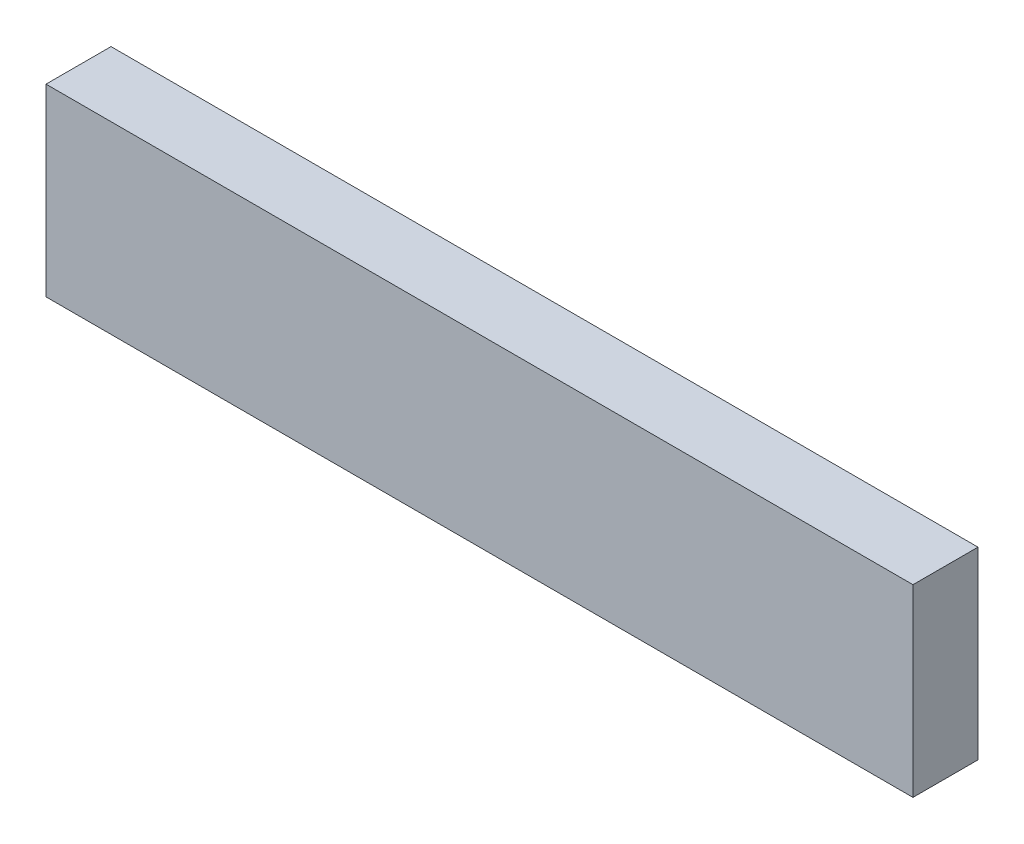
ISO-10303-21;
HEADER;
FILE_DESCRIPTION(('STEP AP214'),'2;1');
FILE_NAME('part.step','',(''),(''),'','','');
FILE_SCHEMA(('AUTOMOTIVE_DESIGN { 1 0 10303 214 1 1 1 1 }'));
ENDSEC;
DATA;
#1=APPLICATION_CONTEXT('core data for automotive mechanical design processes');
#2=APPLICATION_PROTOCOL_DEFINITION('international standard','automotive_design',2000,#1);
#3=PRODUCT_CONTEXT('',#1,'mechanical');
#4=PRODUCT('Part','Part','',(#3));
#5=PRODUCT_RELATED_PRODUCT_CATEGORY('part','',(#4));
#6=PRODUCT_DEFINITION_FORMATION('','',#4);
#7=PRODUCT_DEFINITION_CONTEXT('part definition',#1,'design');
#8=PRODUCT_DEFINITION('design','',#6,#7);
#9=PRODUCT_DEFINITION_SHAPE('','',#8);
#10=(LENGTH_UNIT() NAMED_UNIT(*) SI_UNIT(.MILLI.,.METRE.));
#11=(NAMED_UNIT(*) PLANE_ANGLE_UNIT() SI_UNIT($,.RADIAN.));
#12=(NAMED_UNIT(*) SI_UNIT($,.STERADIAN.) SOLID_ANGLE_UNIT());
#13=UNCERTAINTY_MEASURE_WITH_UNIT(LENGTH_MEASURE(1.E-05),#10,'distance_accuracy_value','');
#14=(GEOMETRIC_REPRESENTATION_CONTEXT(3) GLOBAL_UNCERTAINTY_ASSIGNED_CONTEXT((#13)) GLOBAL_UNIT_ASSIGNED_CONTEXT((#10,
#11,#12)) REPRESENTATION_CONTEXT('',''));
#15=CARTESIAN_POINT('',(0.,0.,0.));
#16=DIRECTION('',(0.,0.,1.));
#17=DIRECTION('',(1.,0.,0.));
#18=AXIS2_PLACEMENT_3D('',#15,#16,#17);
#19=CARTESIAN_POINT('',(0.,0.,-30.));
#20=DIRECTION('',(-1.,0.,0.));
#21=DIRECTION('',(0.,-1.,0.));
#22=AXIS2_PLACEMENT_3D('',#19,#20,#21);
#23=PLANE('',#22);
#24=DIRECTION('',(0.,-1.,0.));
#25=VECTOR('',#24,1.);
#26=CARTESIAN_POINT('',(0.,0.,0.));
#27=LINE('',#26,#25);
#28=CARTESIAN_POINT('',(0.,0.,0.));
#29=VERTEX_POINT('',#28);
#30=CARTESIAN_POINT('',(0.,-85.,0.));
#31=VERTEX_POINT('',#30);
#32=EDGE_CURVE('E102',#29,#31,#27,.T.);
#33=ORIENTED_EDGE('',*,*,#32,.F.);
#34=DIRECTION('',(0.,0.,1.));
#35=VECTOR('',#34,1.);
#36=CARTESIAN_POINT('',(0.,0.,-30.));
#37=LINE('',#36,#35);
#38=CARTESIAN_POINT('',(0.,0.,-30.));
#39=VERTEX_POINT('',#38);
#40=EDGE_CURVE('E11',#39,#29,#37,.T.);
#41=ORIENTED_EDGE('',*,*,#40,.F.);
#42=DIRECTION('',(0.,-1.,0.));
#43=VECTOR('',#42,1.);
#44=CARTESIAN_POINT('',(0.,0.,-30.));
#45=LINE('',#44,#43);
#46=CARTESIAN_POINT('',(0.,-85.,-30.));
#47=VERTEX_POINT('',#46);
#48=EDGE_CURVE('E96',#39,#47,#45,.T.);
#49=ORIENTED_EDGE('',*,*,#48,.T.);
#50=DIRECTION('',(0.,0.,1.));
#51=VECTOR('',#50,1.);
#52=CARTESIAN_POINT('',(0.,-85.,-30.));
#53=LINE('',#52,#51);
#54=EDGE_CURVE('E41',#47,#31,#53,.T.);
#55=ORIENTED_EDGE('',*,*,#54,.T.);
#56=EDGE_LOOP('',(#33,#41,#49,#55));
#57=FACE_BOUND('',#56,.T.);
#58=ADVANCED_FACE('F38',(#57),#23,.T.);
#59=CARTESIAN_POINT('',(0.,0.,-30.));
#60=DIRECTION('',(0.,1.,0.));
#61=DIRECTION('',(0.,0.,1.));
#62=AXIS2_PLACEMENT_3D('',#59,#60,#61);
#63=PLANE('',#62);
#64=DIRECTION('',(-1.,0.,0.));
#65=VECTOR('',#64,1.);
#66=CARTESIAN_POINT('',(0.,0.,0.));
#67=LINE('',#66,#65);
#68=CARTESIAN_POINT('',(400.,0.,0.));
#69=VERTEX_POINT('',#68);
#70=EDGE_CURVE('E98',#69,#29,#67,.T.);
#71=ORIENTED_EDGE('',*,*,#70,.F.);
#72=DIRECTION('',(0.,0.,1.));
#73=VECTOR('',#72,1.);
#74=CARTESIAN_POINT('',(400.,0.,-30.));
#75=LINE('',#74,#73);
#76=CARTESIAN_POINT('',(400.,0.,-30.));
#77=VERTEX_POINT('',#76);
#78=EDGE_CURVE('E47',#77,#69,#75,.T.);
#79=ORIENTED_EDGE('',*,*,#78,.F.);
#80=DIRECTION('',(-1.,0.,0.));
#81=VECTOR('',#80,1.);
#82=CARTESIAN_POINT('',(0.,0.,-30.));
#83=LINE('',#82,#81);
#84=EDGE_CURVE('E93',#77,#39,#83,.T.);
#85=ORIENTED_EDGE('',*,*,#84,.T.);
#86=ORIENTED_EDGE('',*,*,#40,.T.);
#87=EDGE_LOOP('',(#71,#79,#85,#86));
#88=FACE_BOUND('',#87,.T.);
#89=ADVANCED_FACE('F112',(#88),#63,.T.);
#90=CARTESIAN_POINT('',(400.,0.,-30.));
#91=DIRECTION('',(1.,0.,0.));
#92=DIRECTION('',(0.,0.,-1.));
#93=AXIS2_PLACEMENT_3D('',#90,#91,#92);
#94=PLANE('',#93);
#95=DIRECTION('',(0.,1.,0.));
#96=VECTOR('',#95,1.);
#97=CARTESIAN_POINT('',(400.,0.,0.));
#98=LINE('',#97,#96);
#99=CARTESIAN_POINT('',(400.,-85.,0.));
#100=VERTEX_POINT('',#99);
#101=EDGE_CURVE('E88',#100,#69,#98,.T.);
#102=ORIENTED_EDGE('',*,*,#101,.F.);
#103=DIRECTION('',(0.,0.,1.));
#104=VECTOR('',#103,1.);
#105=CARTESIAN_POINT('',(400.,-85.,-30.));
#106=LINE('',#105,#104);
#107=CARTESIAN_POINT('',(400.,-85.,-30.));
#108=VERTEX_POINT('',#107);
#109=EDGE_CURVE('E83',#108,#100,#106,.T.);
#110=ORIENTED_EDGE('',*,*,#109,.F.);
#111=DIRECTION('',(0.,1.,0.));
#112=VECTOR('',#111,1.);
#113=CARTESIAN_POINT('',(400.,0.,-30.));
#114=LINE('',#113,#112);
#115=EDGE_CURVE('E86',#108,#77,#114,.T.);
#116=ORIENTED_EDGE('',*,*,#115,.T.);
#117=ORIENTED_EDGE('',*,*,#78,.T.);
#118=EDGE_LOOP('',(#102,#110,#116,#117));
#119=FACE_BOUND('',#118,.T.);
#120=ADVANCED_FACE('F85',(#119),#94,.T.);
#121=CARTESIAN_POINT('',(0.,-85.,-30.));
#122=DIRECTION('',(0.,-1.,0.));
#123=DIRECTION('',(0.,0.,-1.));
#124=AXIS2_PLACEMENT_3D('',#121,#122,#123);
#125=PLANE('',#124);
#126=DIRECTION('',(1.,0.,0.));
#127=VECTOR('',#126,1.);
#128=CARTESIAN_POINT('',(0.,-85.,0.));
#129=LINE('',#128,#127);
#130=EDGE_CURVE('E105',#31,#100,#129,.T.);
#131=ORIENTED_EDGE('',*,*,#130,.F.);
#132=ORIENTED_EDGE('',*,*,#54,.F.);
#133=DIRECTION('',(1.,0.,0.));
#134=VECTOR('',#133,1.);
#135=CARTESIAN_POINT('',(0.,-85.,-30.));
#136=LINE('',#135,#134);
#137=EDGE_CURVE('E92',#47,#108,#136,.T.);
#138=ORIENTED_EDGE('',*,*,#137,.T.);
#139=ORIENTED_EDGE('',*,*,#109,.T.);
#140=EDGE_LOOP('',(#131,#132,#138,#139));
#141=FACE_BOUND('',#140,.T.);
#142=ADVANCED_FACE('F95',(#141),#125,.T.);
#143=CARTESIAN_POINT('',(0.,0.,-30.));
#144=DIRECTION('',(0.,0.,1.));
#145=DIRECTION('',(1.,0.,0.));
#146=AXIS2_PLACEMENT_3D('',#143,#144,#145);
#147=PLANE('',#146);
#148=ORIENTED_EDGE('',*,*,#48,.F.);
#149=ORIENTED_EDGE('',*,*,#84,.F.);
#150=ORIENTED_EDGE('',*,*,#115,.F.);
#151=ORIENTED_EDGE('',*,*,#137,.F.);
#152=EDGE_LOOP('',(#148,#149,#150,#151));
#153=FACE_BOUND('',#152,.T.);
#154=ADVANCED_FACE('F91',(#153),#147,.F.);
#155=CARTESIAN_POINT('',(0.,0.,0.));
#156=DIRECTION('',(0.,0.,1.));
#157=DIRECTION('',(1.,0.,0.));
#158=AXIS2_PLACEMENT_3D('',#155,#156,#157);
#159=PLANE('',#158);
#160=ORIENTED_EDGE('',*,*,#32,.T.);
#161=ORIENTED_EDGE('',*,*,#130,.T.);
#162=ORIENTED_EDGE('',*,*,#101,.T.);
#163=ORIENTED_EDGE('',*,*,#70,.T.);
#164=EDGE_LOOP('',(#160,#161,#162,#163));
#165=FACE_BOUND('',#164,.T.);
#166=ADVANCED_FACE('F111',(#165),#159,.T.);
#167=CLOSED_SHELL('',(#58,#89,#120,#142,#154,#166));
#168=MANIFOLD_SOLID_BREP('B2',#167);
#169=ADVANCED_BREP_SHAPE_REPRESENTATION('',(#18,#168),#14);
#170=SHAPE_DEFINITION_REPRESENTATION(#9,#169);
ENDSEC;
END-ISO-10303-21;
